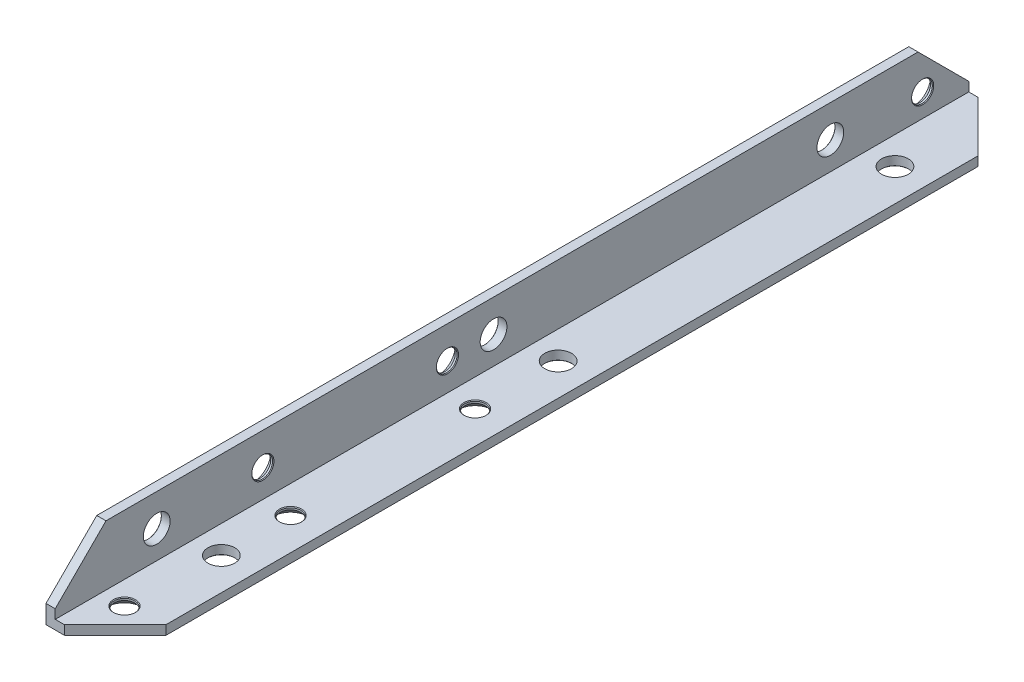
ISO-10303-21;
HEADER;
FILE_DESCRIPTION(('STEP AP214'),'2;1');
FILE_NAME('part.step','',(''),(''),'','','');
FILE_SCHEMA(('AUTOMOTIVE_DESIGN { 1 0 10303 214 1 1 1 1 }'));
ENDSEC;
DATA;
#1=APPLICATION_CONTEXT('core data for automotive mechanical design processes');
#2=APPLICATION_PROTOCOL_DEFINITION('international standard','automotive_design',2000,#1);
#3=PRODUCT_CONTEXT('',#1,'mechanical');
#4=PRODUCT('Part','Part','',(#3));
#5=PRODUCT_RELATED_PRODUCT_CATEGORY('part','',(#4));
#6=PRODUCT_DEFINITION_FORMATION('','',#4);
#7=PRODUCT_DEFINITION_CONTEXT('part definition',#1,'design');
#8=PRODUCT_DEFINITION('design','',#6,#7);
#9=PRODUCT_DEFINITION_SHAPE('','',#8);
#10=(LENGTH_UNIT() NAMED_UNIT(*) SI_UNIT(.MILLI.,.METRE.));
#11=(NAMED_UNIT(*) PLANE_ANGLE_UNIT() SI_UNIT($,.RADIAN.));
#12=(NAMED_UNIT(*) SI_UNIT($,.STERADIAN.) SOLID_ANGLE_UNIT());
#13=UNCERTAINTY_MEASURE_WITH_UNIT(LENGTH_MEASURE(1.E-05),#10,'distance_accuracy_value','');
#14=(GEOMETRIC_REPRESENTATION_CONTEXT(3) GLOBAL_UNCERTAINTY_ASSIGNED_CONTEXT((#13)) GLOBAL_UNIT_ASSIGNED_CONTEXT((#10,
#11,#12)) REPRESENTATION_CONTEXT('',''));
#15=CARTESIAN_POINT('',(0.,0.,0.));
#16=DIRECTION('',(0.,0.,1.));
#17=DIRECTION('',(1.,0.,0.));
#18=AXIS2_PLACEMENT_3D('',#15,#16,#17);
#19=CARTESIAN_POINT('',(15.,0.,198.));
#20=DIRECTION('',(0.,1.,0.));
#21=DIRECTION('',(-1.,0.,0.));
#22=AXIS2_PLACEMENT_3D('',#19,#20,#21);
#23=PLANE('',#22);
#24=CARTESIAN_POINT('',(8.,0.,95.));
#25=DIRECTION('',(0.,-1.,0.));
#26=DIRECTION('',(0.,0.,-1.));
#27=AXIS2_PLACEMENT_3D('',#24,#25,#26);
#28=CIRCLE('',#27,3.);
#29=CARTESIAN_POINT('',(8.,0.,92.));
#30=VERTEX_POINT('',#29);
#31=EDGE_CURVE('E743',#30,#30,#28,.T.);
#32=ORIENTED_EDGE('',*,*,#31,.F.);
#33=EDGE_LOOP('',(#32));
#34=FACE_BOUND('',#33,.T.);
#35=CARTESIAN_POINT('',(8.,0.,22.));
#36=DIRECTION('',(0.,-1.,0.));
#37=DIRECTION('',(0.,0.,-1.));
#38=AXIS2_PLACEMENT_3D('',#35,#36,#37);
#39=CIRCLE('',#38,3.);
#40=CARTESIAN_POINT('',(8.,0.,19.));
#41=VERTEX_POINT('',#40);
#42=EDGE_CURVE('E220',#41,#41,#39,.T.);
#43=ORIENTED_EDGE('',*,*,#42,.F.);
#44=EDGE_LOOP('',(#43));
#45=FACE_BOUND('',#44,.T.);
#46=CARTESIAN_POINT('',(8.,0.,168.));
#47=DIRECTION('',(0.,-1.,0.));
#48=DIRECTION('',(0.,0.,-1.));
#49=AXIS2_PLACEMENT_3D('',#46,#47,#48);
#50=CIRCLE('',#49,3.);
#51=CARTESIAN_POINT('',(8.,0.,165.));
#52=VERTEX_POINT('',#51);
#53=EDGE_CURVE('E213',#52,#52,#50,.T.);
#54=ORIENTED_EDGE('',*,*,#53,.F.);
#55=EDGE_LOOP('',(#54));
#56=FACE_BOUND('',#55,.T.);
#57=CARTESIAN_POINT('',(7.,0.,188.));
#58=DIRECTION('',(0.,-1.,0.));
#59=DIRECTION('',(0.,0.,-1.));
#60=AXIS2_PLACEMENT_3D('',#57,#58,#59);
#61=CIRCLE('',#60,3.7);
#62=CARTESIAN_POINT('',(7.,0.,184.3));
#63=VERTEX_POINT('',#62);
#64=EDGE_CURVE('E280',#63,#63,#61,.T.);
#65=ORIENTED_EDGE('',*,*,#64,.F.);
#66=EDGE_LOOP('',(#65));
#67=FACE_BOUND('',#66,.T.);
#68=DIRECTION('',(1.,0.,0.));
#69=VECTOR('',#68,1.);
#70=CARTESIAN_POINT('',(15.,0.,0.));
#71=LINE('',#70,#69);
#72=CARTESIAN_POINT('',(0.,0.,0.));
#73=VERTEX_POINT('',#72);
#74=CARTESIAN_POINT('',(3.99999999999999,0.,0.));
#75=VERTEX_POINT('',#74);
#76=EDGE_CURVE('E144',#73,#75,#71,.T.);
#77=ORIENTED_EDGE('',*,*,#76,.T.);
#78=DIRECTION('',(0.707106781186548,0.,0.707106781186547));
#79=VECTOR('',#78,1.);
#80=CARTESIAN_POINT('',(15.,0.,11.));
#81=LINE('',#80,#79);
#82=CARTESIAN_POINT('',(15.,0.,11.));
#83=VERTEX_POINT('',#82);
#84=EDGE_CURVE('E189',#75,#83,#81,.T.);
#85=ORIENTED_EDGE('',*,*,#84,.T.);
#86=DIRECTION('',(0.,0.,-1.));
#87=VECTOR('',#86,1.);
#88=CARTESIAN_POINT('',(15.,0.,198.));
#89=LINE('',#88,#87);
#90=CARTESIAN_POINT('',(15.,0.,187.));
#91=VERTEX_POINT('',#90);
#92=EDGE_CURVE('E161',#91,#83,#89,.T.);
#93=ORIENTED_EDGE('',*,*,#92,.F.);
#94=DIRECTION('',(0.707106781186547,0.,-0.707106781186548));
#95=VECTOR('',#94,1.);
#96=CARTESIAN_POINT('',(4.00000000000002,0.,198.));
#97=LINE('',#96,#95);
#98=CARTESIAN_POINT('',(4.00000000000002,0.,198.));
#99=VERTEX_POINT('',#98);
#100=EDGE_CURVE('E48',#91,#99,#97,.F.);
#101=ORIENTED_EDGE('',*,*,#100,.T.);
#102=DIRECTION('',(1.,0.,0.));
#103=VECTOR('',#102,1.);
#104=CARTESIAN_POINT('',(15.,0.,198.));
#105=LINE('',#104,#103);
#106=CARTESIAN_POINT('',(0.,0.,198.));
#107=VERTEX_POINT('',#106);
#108=EDGE_CURVE('E120',#107,#99,#105,.T.);
#109=ORIENTED_EDGE('',*,*,#108,.F.);
#110=DIRECTION('',(0.,0.,-1.));
#111=VECTOR('',#110,1.);
#112=CARTESIAN_POINT('',(0.,0.,198.));
#113=LINE('',#112,#111);
#114=EDGE_CURVE('E140',#107,#73,#113,.T.);
#115=ORIENTED_EDGE('',*,*,#114,.T.);
#116=EDGE_LOOP('',(#77,#85,#93,#101,#109,#115));
#117=FACE_BOUND('',#116,.T.);
#118=CARTESIAN_POINT('',(8.,0.,113.));
#119=DIRECTION('',(0.,-1.,0.));
#120=DIRECTION('',(0.,0.,-1.));
#121=AXIS2_PLACEMENT_3D('',#118,#119,#120);
#122=CIRCLE('',#121,3.7);
#123=CARTESIAN_POINT('',(8.,0.,109.3));
#124=VERTEX_POINT('',#123);
#125=EDGE_CURVE('E304',#124,#124,#122,.T.);
#126=ORIENTED_EDGE('',*,*,#125,.F.);
#127=EDGE_LOOP('',(#126));
#128=FACE_BOUND('',#127,.T.);
#129=CARTESIAN_POINT('',(8.,0.,153.));
#130=DIRECTION('',(0.,-1.,0.));
#131=DIRECTION('',(0.,0.,-1.));
#132=AXIS2_PLACEMENT_3D('',#129,#130,#131);
#133=CIRCLE('',#132,3.7);
#134=CARTESIAN_POINT('',(8.,0.,149.3));
#135=VERTEX_POINT('',#134);
#136=EDGE_CURVE('E292',#135,#135,#133,.T.);
#137=ORIENTED_EDGE('',*,*,#136,.F.);
#138=EDGE_LOOP('',(#137));
#139=FACE_BOUND('',#138,.T.);
#140=ADVANCED_FACE('F31',(#34,#45,#56,#67,#117,#128,#139),#23,.F.);
#141=CARTESIAN_POINT('',(15.,2.,198.));
#142=DIRECTION('',(-1.,0.,0.));
#143=DIRECTION('',(0.,-1.,0.));
#144=AXIS2_PLACEMENT_3D('',#141,#142,#143);
#145=PLANE('',#144);
#146=ORIENTED_EDGE('',*,*,#92,.T.);
#147=DIRECTION('',(0.,1.,0.));
#148=VECTOR('',#147,1.);
#149=CARTESIAN_POINT('',(15.,2.,11.));
#150=LINE('',#149,#148);
#151=CARTESIAN_POINT('',(15.,2.,11.));
#152=VERTEX_POINT('',#151);
#153=EDGE_CURVE('E182',#83,#152,#150,.T.);
#154=ORIENTED_EDGE('',*,*,#153,.T.);
#155=DIRECTION('',(0.,0.,-1.));
#156=VECTOR('',#155,1.);
#157=CARTESIAN_POINT('',(15.,2.,198.));
#158=LINE('',#157,#156);
#159=CARTESIAN_POINT('',(15.,2.,187.));
#160=VERTEX_POINT('',#159);
#161=EDGE_CURVE('E131',#160,#152,#158,.T.);
#162=ORIENTED_EDGE('',*,*,#161,.F.);
#163=DIRECTION('',(0.,-1.,0.));
#164=VECTOR('',#163,1.);
#165=CARTESIAN_POINT('',(15.,2.,187.));
#166=LINE('',#165,#164);
#167=EDGE_CURVE('E180',#160,#91,#166,.T.);
#168=ORIENTED_EDGE('',*,*,#167,.T.);
#169=EDGE_LOOP('',(#146,#154,#162,#168));
#170=FACE_BOUND('',#169,.T.);
#171=ADVANCED_FACE('F316',(#170),#145,.F.);
#172=CARTESIAN_POINT('',(2.,2.,198.));
#173=DIRECTION('',(0.,-1.,0.));
#174=DIRECTION('',(0.,0.,-1.));
#175=AXIS2_PLACEMENT_3D('',#172,#173,#174);
#176=PLANE('',#175);
#177=CARTESIAN_POINT('',(8.,2.,95.));
#178=DIRECTION('',(0.,-1.,0.));
#179=DIRECTION('',(0.,0.,-1.));
#180=AXIS2_PLACEMENT_3D('',#177,#178,#179);
#181=CIRCLE('',#180,2.89999999999999);
#182=CARTESIAN_POINT('',(8.,2.,92.1));
#183=VERTEX_POINT('',#182);
#184=EDGE_CURVE('E35',#183,#183,#181,.T.);
#185=ORIENTED_EDGE('',*,*,#184,.T.);
#186=EDGE_LOOP('',(#185));
#187=FACE_BOUND('',#186,.T.);
#188=CARTESIAN_POINT('',(8.,2.,22.));
#189=DIRECTION('',(0.,-1.,0.));
#190=DIRECTION('',(0.,0.,-1.));
#191=AXIS2_PLACEMENT_3D('',#188,#189,#190);
#192=CIRCLE('',#191,2.89999999999999);
#193=CARTESIAN_POINT('',(8.,2.,19.1));
#194=VERTEX_POINT('',#193);
#195=EDGE_CURVE('E211',#194,#194,#192,.T.);
#196=ORIENTED_EDGE('',*,*,#195,.T.);
#197=EDGE_LOOP('',(#196));
#198=FACE_BOUND('',#197,.T.);
#199=CARTESIAN_POINT('',(8.,2.,168.));
#200=DIRECTION('',(0.,-1.,0.));
#201=DIRECTION('',(0.,0.,-1.));
#202=AXIS2_PLACEMENT_3D('',#199,#200,#201);
#203=CIRCLE('',#202,2.89999999999999);
#204=CARTESIAN_POINT('',(8.,2.,165.1));
#205=VERTEX_POINT('',#204);
#206=EDGE_CURVE('E207',#205,#205,#203,.T.);
#207=ORIENTED_EDGE('',*,*,#206,.T.);
#208=EDGE_LOOP('',(#207));
#209=FACE_BOUND('',#208,.T.);
#210=CARTESIAN_POINT('',(7.,2.,188.));
#211=DIRECTION('',(0.,-1.,0.));
#212=DIRECTION('',(0.,0.,-1.));
#213=AXIS2_PLACEMENT_3D('',#210,#211,#212);
#214=CIRCLE('',#213,2.4);
#215=CARTESIAN_POINT('',(7.,2.,185.6));
#216=VERTEX_POINT('',#215);
#217=EDGE_CURVE('E277',#216,#216,#214,.T.);
#218=ORIENTED_EDGE('',*,*,#217,.T.);
#219=EDGE_LOOP('',(#218));
#220=FACE_BOUND('',#219,.T.);
#221=CARTESIAN_POINT('',(8.,2.,153.));
#222=DIRECTION('',(0.,-1.,0.));
#223=DIRECTION('',(0.,0.,-1.));
#224=AXIS2_PLACEMENT_3D('',#221,#222,#223);
#225=CIRCLE('',#224,2.4);
#226=CARTESIAN_POINT('',(8.,2.,150.6));
#227=VERTEX_POINT('',#226);
#228=EDGE_CURVE('E289',#227,#227,#225,.T.);
#229=ORIENTED_EDGE('',*,*,#228,.T.);
#230=EDGE_LOOP('',(#229));
#231=FACE_BOUND('',#230,.T.);
#232=CARTESIAN_POINT('',(8.,2.,113.));
#233=DIRECTION('',(0.,-1.,0.));
#234=DIRECTION('',(0.,0.,-1.));
#235=AXIS2_PLACEMENT_3D('',#232,#233,#234);
#236=CIRCLE('',#235,2.4);
#237=CARTESIAN_POINT('',(8.,2.,110.6));
#238=VERTEX_POINT('',#237);
#239=EDGE_CURVE('E301',#238,#238,#236,.T.);
#240=ORIENTED_EDGE('',*,*,#239,.T.);
#241=EDGE_LOOP('',(#240));
#242=FACE_BOUND('',#241,.T.);
#243=ORIENTED_EDGE('',*,*,#161,.T.);
#244=DIRECTION('',(-0.707106781186548,0.,-0.707106781186547));
#245=VECTOR('',#244,1.);
#246=CARTESIAN_POINT('',(15.,2.,11.));
#247=LINE('',#246,#245);
#248=CARTESIAN_POINT('',(3.99999999999999,2.,0.));
#249=VERTEX_POINT('',#248);
#250=EDGE_CURVE('E186',#152,#249,#247,.T.);
#251=ORIENTED_EDGE('',*,*,#250,.T.);
#252=DIRECTION('',(-1.,0.,0.));
#253=VECTOR('',#252,1.);
#254=CARTESIAN_POINT('',(2.,2.,0.));
#255=LINE('',#254,#253);
#256=CARTESIAN_POINT('',(2.,2.,0.));
#257=VERTEX_POINT('',#256);
#258=EDGE_CURVE('E127',#249,#257,#255,.T.);
#259=ORIENTED_EDGE('',*,*,#258,.T.);
#260=DIRECTION('',(0.,0.,-1.));
#261=VECTOR('',#260,1.);
#262=CARTESIAN_POINT('',(2.,2.,198.));
#263=LINE('',#262,#261);
#264=CARTESIAN_POINT('',(2.,2.,198.));
#265=VERTEX_POINT('',#264);
#266=EDGE_CURVE('E123',#265,#257,#263,.T.);
#267=ORIENTED_EDGE('',*,*,#266,.F.);
#268=DIRECTION('',(-1.,0.,0.));
#269=VECTOR('',#268,1.);
#270=CARTESIAN_POINT('',(2.,2.,198.));
#271=LINE('',#270,#269);
#272=CARTESIAN_POINT('',(4.00000000000002,2.,198.));
#273=VERTEX_POINT('',#272);
#274=EDGE_CURVE('E112',#273,#265,#271,.T.);
#275=ORIENTED_EDGE('',*,*,#274,.F.);
#276=DIRECTION('',(-0.707106781186547,0.,0.707106781186548));
#277=VECTOR('',#276,1.);
#278=CARTESIAN_POINT('',(4.00000000000002,2.,198.));
#279=LINE('',#278,#277);
#280=EDGE_CURVE('E56',#273,#160,#279,.F.);
#281=ORIENTED_EDGE('',*,*,#280,.T.);
#282=EDGE_LOOP('',(#243,#251,#259,#267,#275,#281));
#283=FACE_BOUND('',#282,.T.);
#284=ADVANCED_FACE('F125',(#187,#198,#209,#220,#231,#242,#283),#176,.F.);
#285=CARTESIAN_POINT('',(2.,15.,198.));
#286=DIRECTION('',(-1.,0.,0.));
#287=DIRECTION('',(0.,-1.,0.));
#288=AXIS2_PLACEMENT_3D('',#285,#286,#287);
#289=PLANE('',#288);
#290=CARTESIAN_POINT('',(2.,7.99999999999992,103.));
#291=DIRECTION('',(-1.,0.,0.));
#292=DIRECTION('',(0.,-1.,0.));
#293=AXIS2_PLACEMENT_3D('',#290,#291,#292);
#294=CIRCLE('',#293,2.89999999999999);
#295=CARTESIAN_POINT('',(2.,5.09999999999993,103.));
#296=VERTEX_POINT('',#295);
#297=EDGE_CURVE('E202',#296,#296,#294,.T.);
#298=ORIENTED_EDGE('',*,*,#297,.T.);
#299=EDGE_LOOP('',(#298));
#300=FACE_BOUND('',#299,.T.);
#301=CARTESIAN_POINT('',(2.,7.99999999999992,30.0000000000001));
#302=DIRECTION('',(-1.,0.,0.));
#303=DIRECTION('',(0.,-1.,0.));
#304=AXIS2_PLACEMENT_3D('',#301,#302,#303);
#305=CIRCLE('',#304,2.89999999999999);
#306=CARTESIAN_POINT('',(2.,5.09999999999993,30.0000000000001));
#307=VERTEX_POINT('',#306);
#308=EDGE_CURVE('E197',#307,#307,#305,.T.);
#309=ORIENTED_EDGE('',*,*,#308,.T.);
#310=EDGE_LOOP('',(#309));
#311=FACE_BOUND('',#310,.T.);
#312=CARTESIAN_POINT('',(2.,7.99999999999992,176.));
#313=DIRECTION('',(-1.,0.,0.));
#314=DIRECTION('',(0.,-1.,0.));
#315=AXIS2_PLACEMENT_3D('',#312,#313,#314);
#316=CIRCLE('',#315,2.89999999999999);
#317=CARTESIAN_POINT('',(2.,5.09999999999993,176.));
#318=VERTEX_POINT('',#317);
#319=EDGE_CURVE('E192',#318,#318,#316,.T.);
#320=ORIENTED_EDGE('',*,*,#319,.T.);
#321=EDGE_LOOP('',(#320));
#322=FACE_BOUND('',#321,.T.);
#323=CARTESIAN_POINT('',(2.,7.,10.));
#324=DIRECTION('',(-1.,0.,0.));
#325=DIRECTION('',(0.,0.,1.));
#326=AXIS2_PLACEMENT_3D('',#323,#324,#325);
#327=CIRCLE('',#326,2.4);
#328=CARTESIAN_POINT('',(2.,7.,12.4));
#329=VERTEX_POINT('',#328);
#330=EDGE_CURVE('E195',#329,#329,#327,.T.);
#331=ORIENTED_EDGE('',*,*,#330,.T.);
#332=EDGE_LOOP('',(#331));
#333=FACE_BOUND('',#332,.T.);
#334=CARTESIAN_POINT('',(2.,8.,113.));
#335=DIRECTION('',(-1.,0.,0.));
#336=DIRECTION('',(0.,0.,1.));
#337=AXIS2_PLACEMENT_3D('',#334,#335,#336);
#338=CIRCLE('',#337,2.4);
#339=CARTESIAN_POINT('',(2.,8.,115.4));
#340=VERTEX_POINT('',#339);
#341=EDGE_CURVE('E253',#340,#340,#338,.T.);
#342=ORIENTED_EDGE('',*,*,#341,.T.);
#343=EDGE_LOOP('',(#342));
#344=FACE_BOUND('',#343,.T.);
#345=CARTESIAN_POINT('',(2.,8.,153.));
#346=DIRECTION('',(-1.,0.,0.));
#347=DIRECTION('',(0.,0.,1.));
#348=AXIS2_PLACEMENT_3D('',#345,#346,#347);
#349=CIRCLE('',#348,2.4);
#350=CARTESIAN_POINT('',(2.,8.,155.4));
#351=VERTEX_POINT('',#350);
#352=EDGE_CURVE('E265',#351,#351,#349,.T.);
#353=ORIENTED_EDGE('',*,*,#352,.T.);
#354=EDGE_LOOP('',(#353));
#355=FACE_BOUND('',#354,.T.);
#356=DIRECTION('',(0.,1.,0.));
#357=VECTOR('',#356,1.);
#358=CARTESIAN_POINT('',(2.,15.,0.));
#359=LINE('',#358,#357);
#360=CARTESIAN_POINT('',(2.,4.00000000000001,0.));
#361=VERTEX_POINT('',#360);
#362=EDGE_CURVE('E149',#257,#361,#359,.T.);
#363=ORIENTED_EDGE('',*,*,#362,.T.);
#364=DIRECTION('',(0.,0.707106781186548,0.707106781186547));
#365=VECTOR('',#364,1.);
#366=CARTESIAN_POINT('',(2.,15.,11.));
#367=LINE('',#366,#365);
#368=CARTESIAN_POINT('',(2.,15.,11.));
#369=VERTEX_POINT('',#368);
#370=EDGE_CURVE('E178',#361,#369,#367,.T.);
#371=ORIENTED_EDGE('',*,*,#370,.T.);
#372=DIRECTION('',(0.,0.,-1.));
#373=VECTOR('',#372,1.);
#374=CARTESIAN_POINT('',(2.,15.,198.));
#375=LINE('',#374,#373);
#376=CARTESIAN_POINT('',(2.,15.,187.));
#377=VERTEX_POINT('',#376);
#378=EDGE_CURVE('E132',#377,#369,#375,.T.);
#379=ORIENTED_EDGE('',*,*,#378,.F.);
#380=DIRECTION('',(0.,0.707106781186547,-0.707106781186548));
#381=VECTOR('',#380,1.);
#382=CARTESIAN_POINT('',(2.,4.00000000000001,198.));
#383=LINE('',#382,#381);
#384=CARTESIAN_POINT('',(2.,4.00000000000002,198.));
#385=VERTEX_POINT('',#384);
#386=EDGE_CURVE('E137',#377,#385,#383,.F.);
#387=ORIENTED_EDGE('',*,*,#386,.T.);
#388=DIRECTION('',(0.,1.,0.));
#389=VECTOR('',#388,1.);
#390=CARTESIAN_POINT('',(2.,15.,198.));
#391=LINE('',#390,#389);
#392=EDGE_CURVE('E117',#265,#385,#391,.T.);
#393=ORIENTED_EDGE('',*,*,#392,.F.);
#394=ORIENTED_EDGE('',*,*,#266,.T.);
#395=EDGE_LOOP('',(#363,#371,#379,#387,#393,#394));
#396=FACE_BOUND('',#395,.T.);
#397=ADVANCED_FACE('F134',(#300,#311,#322,#333,#344,#355,#396),#289,.F.);
#398=CARTESIAN_POINT('',(0.,15.,198.));
#399=DIRECTION('',(0.,-1.,0.));
#400=DIRECTION('',(1.,0.,0.));
#401=AXIS2_PLACEMENT_3D('',#398,#399,#400);
#402=PLANE('',#401);
#403=ORIENTED_EDGE('',*,*,#378,.T.);
#404=DIRECTION('',(-1.,0.,0.));
#405=VECTOR('',#404,1.);
#406=CARTESIAN_POINT('',(0.,15.,11.));
#407=LINE('',#406,#405);
#408=CARTESIAN_POINT('',(0.,15.,11.));
#409=VERTEX_POINT('',#408);
#410=EDGE_CURVE('E166',#369,#409,#407,.T.);
#411=ORIENTED_EDGE('',*,*,#410,.T.);
#412=DIRECTION('',(0.,0.,-1.));
#413=VECTOR('',#412,1.);
#414=CARTESIAN_POINT('',(0.,15.,198.));
#415=LINE('',#414,#413);
#416=CARTESIAN_POINT('',(0.,15.,187.));
#417=VERTEX_POINT('',#416);
#418=EDGE_CURVE('E155',#417,#409,#415,.T.);
#419=ORIENTED_EDGE('',*,*,#418,.F.);
#420=DIRECTION('',(1.,0.,0.));
#421=VECTOR('',#420,1.);
#422=CARTESIAN_POINT('',(0.,15.,187.));
#423=LINE('',#422,#421);
#424=EDGE_CURVE('E164',#417,#377,#423,.T.);
#425=ORIENTED_EDGE('',*,*,#424,.T.);
#426=EDGE_LOOP('',(#403,#411,#419,#425));
#427=FACE_BOUND('',#426,.T.);
#428=ADVANCED_FACE('F334',(#427),#402,.F.);
#429=CARTESIAN_POINT('',(0.,0.,198.));
#430=DIRECTION('',(1.,0.,0.));
#431=DIRECTION('',(0.,0.,-1.));
#432=AXIS2_PLACEMENT_3D('',#429,#430,#431);
#433=PLANE('',#432);
#434=CARTESIAN_POINT('',(0.,7.99999999999992,103.));
#435=DIRECTION('',(-1.,0.,0.));
#436=DIRECTION('',(0.,0.,1.));
#437=AXIS2_PLACEMENT_3D('',#434,#435,#436);
#438=CIRCLE('',#437,3.);
#439=CARTESIAN_POINT('',(0.,7.99999999999992,106.));
#440=VERTEX_POINT('',#439);
#441=EDGE_CURVE('E209',#440,#440,#438,.T.);
#442=ORIENTED_EDGE('',*,*,#441,.F.);
#443=EDGE_LOOP('',(#442));
#444=FACE_BOUND('',#443,.T.);
#445=CARTESIAN_POINT('',(0.,7.99999999999992,30.0000000000001));
#446=DIRECTION('',(-1.,0.,0.));
#447=DIRECTION('',(0.,0.,1.));
#448=AXIS2_PLACEMENT_3D('',#445,#446,#447);
#449=CIRCLE('',#448,3.);
#450=CARTESIAN_POINT('',(0.,7.99999999999992,33.0000000000001));
#451=VERTEX_POINT('',#450);
#452=EDGE_CURVE('E205',#451,#451,#449,.T.);
#453=ORIENTED_EDGE('',*,*,#452,.F.);
#454=EDGE_LOOP('',(#453));
#455=FACE_BOUND('',#454,.T.);
#456=CARTESIAN_POINT('',(0.,7.99999999999992,176.));
#457=DIRECTION('',(-1.,0.,0.));
#458=DIRECTION('',(0.,0.,1.));
#459=AXIS2_PLACEMENT_3D('',#456,#457,#458);
#460=CIRCLE('',#459,3.);
#461=CARTESIAN_POINT('',(0.,7.99999999999992,179.));
#462=VERTEX_POINT('',#461);
#463=EDGE_CURVE('E200',#462,#462,#460,.T.);
#464=ORIENTED_EDGE('',*,*,#463,.F.);
#465=EDGE_LOOP('',(#464));
#466=FACE_BOUND('',#465,.T.);
#467=CARTESIAN_POINT('',(0.,7.,10.));
#468=DIRECTION('',(-1.,0.,0.));
#469=DIRECTION('',(0.,0.,1.));
#470=AXIS2_PLACEMENT_3D('',#467,#468,#469);
#471=CIRCLE('',#470,3.7);
#472=CARTESIAN_POINT('',(0.,7.,13.7));
#473=VERTEX_POINT('',#472);
#474=EDGE_CURVE('E244',#473,#473,#471,.T.);
#475=ORIENTED_EDGE('',*,*,#474,.F.);
#476=EDGE_LOOP('',(#475));
#477=FACE_BOUND('',#476,.T.);
#478=CARTESIAN_POINT('',(0.,8.,113.));
#479=DIRECTION('',(-1.,0.,0.));
#480=DIRECTION('',(0.,0.,1.));
#481=AXIS2_PLACEMENT_3D('',#478,#479,#480);
#482=CIRCLE('',#481,3.7);
#483=CARTESIAN_POINT('',(0.,8.,116.7));
#484=VERTEX_POINT('',#483);
#485=EDGE_CURVE('E256',#484,#484,#482,.T.);
#486=ORIENTED_EDGE('',*,*,#485,.F.);
#487=EDGE_LOOP('',(#486));
#488=FACE_BOUND('',#487,.T.);
#489=CARTESIAN_POINT('',(0.,8.,153.));
#490=DIRECTION('',(-1.,0.,0.));
#491=DIRECTION('',(0.,0.,1.));
#492=AXIS2_PLACEMENT_3D('',#489,#490,#491);
#493=CIRCLE('',#492,3.7);
#494=CARTESIAN_POINT('',(0.,8.,156.7));
#495=VERTEX_POINT('',#494);
#496=EDGE_CURVE('E268',#495,#495,#493,.T.);
#497=ORIENTED_EDGE('',*,*,#496,.F.);
#498=EDGE_LOOP('',(#497));
#499=FACE_BOUND('',#498,.T.);
#500=ORIENTED_EDGE('',*,*,#418,.T.);
#501=DIRECTION('',(0.,-0.707106781186548,-0.707106781186547));
#502=VECTOR('',#501,1.);
#503=CARTESIAN_POINT('',(0.,15.,11.));
#504=LINE('',#503,#502);
#505=CARTESIAN_POINT('',(0.,4.00000000000001,0.));
#506=VERTEX_POINT('',#505);
#507=EDGE_CURVE('E171',#409,#506,#504,.T.);
#508=ORIENTED_EDGE('',*,*,#507,.T.);
#509=DIRECTION('',(0.,-1.,0.));
#510=VECTOR('',#509,1.);
#511=CARTESIAN_POINT('',(0.,0.,0.));
#512=LINE('',#511,#510);
#513=EDGE_CURVE('E151',#506,#73,#512,.T.);
#514=ORIENTED_EDGE('',*,*,#513,.T.);
#515=ORIENTED_EDGE('',*,*,#114,.F.);
#516=DIRECTION('',(0.,-1.,0.));
#517=VECTOR('',#516,1.);
#518=CARTESIAN_POINT('',(0.,0.,198.));
#519=LINE('',#518,#517);
#520=CARTESIAN_POINT('',(0.,4.00000000000001,198.));
#521=VERTEX_POINT('',#520);
#522=EDGE_CURVE('E138',#521,#107,#519,.T.);
#523=ORIENTED_EDGE('',*,*,#522,.F.);
#524=DIRECTION('',(0.,-0.707106781186547,0.707106781186548));
#525=VECTOR('',#524,1.);
#526=CARTESIAN_POINT('',(0.,4.00000000000001,198.));
#527=LINE('',#526,#525);
#528=EDGE_CURVE('E169',#521,#417,#527,.F.);
#529=ORIENTED_EDGE('',*,*,#528,.T.);
#530=EDGE_LOOP('',(#500,#508,#514,#515,#523,#529));
#531=FACE_BOUND('',#530,.T.);
#532=ADVANCED_FACE('F337',(#444,#455,#466,#477,#488,#499,#531),#433,.F.);
#533=CARTESIAN_POINT('',(0.,0.,198.));
#534=DIRECTION('',(0.,0.,-1.));
#535=DIRECTION('',(-1.,0.,0.));
#536=AXIS2_PLACEMENT_3D('',#533,#534,#535);
#537=PLANE('',#536);
#538=ORIENTED_EDGE('',*,*,#108,.T.);
#539=DIRECTION('',(0.,1.,0.));
#540=VECTOR('',#539,1.);
#541=CARTESIAN_POINT('',(4.00000000000002,0.,198.));
#542=LINE('',#541,#540);
#543=EDGE_CURVE('E11',#99,#273,#542,.T.);
#544=ORIENTED_EDGE('',*,*,#543,.T.);
#545=ORIENTED_EDGE('',*,*,#274,.T.);
#546=ORIENTED_EDGE('',*,*,#392,.T.);
#547=DIRECTION('',(-1.,0.,0.));
#548=VECTOR('',#547,1.);
#549=CARTESIAN_POINT('',(0.,4.00000000000001,198.));
#550=LINE('',#549,#548);
#551=EDGE_CURVE('E40',#385,#521,#550,.T.);
#552=ORIENTED_EDGE('',*,*,#551,.T.);
#553=ORIENTED_EDGE('',*,*,#522,.T.);
#554=EDGE_LOOP('',(#538,#544,#545,#546,#552,#553));
#555=FACE_BOUND('',#554,.T.);
#556=ADVANCED_FACE('F114',(#555),#537,.F.);
#557=CARTESIAN_POINT('',(0.,0.,0.));
#558=DIRECTION('',(0.,0.,-1.));
#559=DIRECTION('',(-1.,0.,0.));
#560=AXIS2_PLACEMENT_3D('',#557,#558,#559);
#561=PLANE('',#560);
#562=ORIENTED_EDGE('',*,*,#513,.F.);
#563=DIRECTION('',(1.,0.,0.));
#564=VECTOR('',#563,1.);
#565=CARTESIAN_POINT('',(2.00000000000001,4.00000000000001,0.));
#566=LINE('',#565,#564);
#567=EDGE_CURVE('E175',#506,#361,#566,.T.);
#568=ORIENTED_EDGE('',*,*,#567,.T.);
#569=ORIENTED_EDGE('',*,*,#362,.F.);
#570=ORIENTED_EDGE('',*,*,#258,.F.);
#571=DIRECTION('',(0.,-1.,0.));
#572=VECTOR('',#571,1.);
#573=CARTESIAN_POINT('',(3.99999999999999,0.,0.));
#574=LINE('',#573,#572);
#575=EDGE_CURVE('E173',#249,#75,#574,.T.);
#576=ORIENTED_EDGE('',*,*,#575,.T.);
#577=ORIENTED_EDGE('',*,*,#76,.F.);
#578=EDGE_LOOP('',(#562,#568,#569,#570,#576,#577));
#579=FACE_BOUND('',#578,.T.);
#580=ADVANCED_FACE('F326',(#579),#561,.T.);
#581=CARTESIAN_POINT('',(0.,15.,11.));
#582=DIRECTION('',(0.,0.707106781186547,-0.707106781186548));
#583=DIRECTION('',(0.,0.707106781186548,0.707106781186547));
#584=AXIS2_PLACEMENT_3D('',#581,#582,#583);
#585=PLANE('',#584);
#586=ORIENTED_EDGE('',*,*,#370,.F.);
#587=ORIENTED_EDGE('',*,*,#567,.F.);
#588=ORIENTED_EDGE('',*,*,#507,.F.);
#589=ORIENTED_EDGE('',*,*,#410,.F.);
#590=EDGE_LOOP('',(#586,#587,#588,#589));
#591=FACE_BOUND('',#590,.T.);
#592=ADVANCED_FACE('F331',(#591),#585,.T.);
#593=CARTESIAN_POINT('',(15.,2.,11.));
#594=DIRECTION('',(0.707106781186547,0.,-0.707106781186548));
#595=DIRECTION('',(-0.707106781186548,0.,-0.707106781186547));
#596=AXIS2_PLACEMENT_3D('',#593,#594,#595);
#597=PLANE('',#596);
#598=ORIENTED_EDGE('',*,*,#84,.F.);
#599=ORIENTED_EDGE('',*,*,#575,.F.);
#600=ORIENTED_EDGE('',*,*,#250,.F.);
#601=ORIENTED_EDGE('',*,*,#153,.F.);
#602=EDGE_LOOP('',(#598,#599,#600,#601));
#603=FACE_BOUND('',#602,.T.);
#604=ADVANCED_FACE('F323',(#603),#597,.T.);
#605=CARTESIAN_POINT('',(4.00000000000002,0.,198.));
#606=DIRECTION('',(-0.707106781186548,0.,-0.707106781186547));
#607=DIRECTION('',(-0.707106781186547,0.,0.707106781186548));
#608=AXIS2_PLACEMENT_3D('',#605,#606,#607);
#609=PLANE('',#608);
#610=ORIENTED_EDGE('',*,*,#100,.F.);
#611=ORIENTED_EDGE('',*,*,#167,.F.);
#612=ORIENTED_EDGE('',*,*,#280,.F.);
#613=ORIENTED_EDGE('',*,*,#543,.F.);
#614=EDGE_LOOP('',(#610,#611,#612,#613));
#615=FACE_BOUND('',#614,.T.);
#616=ADVANCED_FACE('F313',(#615),#609,.F.);
#617=CARTESIAN_POINT('',(0.,4.00000000000001,198.));
#618=DIRECTION('',(0.,-0.707106781186548,-0.707106781186547));
#619=DIRECTION('',(0.,0.707106781186547,-0.707106781186548));
#620=AXIS2_PLACEMENT_3D('',#617,#618,#619);
#621=PLANE('',#620);
#622=ORIENTED_EDGE('',*,*,#386,.F.);
#623=ORIENTED_EDGE('',*,*,#424,.F.);
#624=ORIENTED_EDGE('',*,*,#528,.F.);
#625=ORIENTED_EDGE('',*,*,#551,.F.);
#626=EDGE_LOOP('',(#622,#623,#624,#625));
#627=FACE_BOUND('',#626,.T.);
#628=ADVANCED_FACE('F33',(#627),#621,.F.);
#629=CARTESIAN_POINT('',(8.,1.85,113.));
#630=DIRECTION('',(0.,1.,0.));
#631=DIRECTION('',(0.,0.,1.));
#632=AXIS2_PLACEMENT_3D('',#629,#630,#631);
#633=CONICAL_SURFACE('',#632,2.25,0.785398163397442);
#634=ORIENTED_EDGE('',*,*,#239,.F.);
#635=EDGE_LOOP('',(#634));
#636=FACE_BOUND('',#635,.T.);
#637=CARTESIAN_POINT('',(8.,1.85,113.));
#638=DIRECTION('',(0.,-1.,0.));
#639=DIRECTION('',(0.,0.,-1.));
#640=AXIS2_PLACEMENT_3D('',#637,#638,#639);
#641=CIRCLE('',#640,2.25);
#642=CARTESIAN_POINT('',(8.,1.85,110.75));
#643=VERTEX_POINT('',#642);
#644=EDGE_CURVE('E147',#643,#643,#641,.T.);
#645=ORIENTED_EDGE('',*,*,#644,.T.);
#646=EDGE_LOOP('',(#645));
#647=FACE_BOUND('',#646,.T.);
#648=ADVANCED_FACE('F340',(#636,#647),#633,.F.);
#649=CARTESIAN_POINT('',(8.,0.,113.));
#650=DIRECTION('',(0.,-1.,0.));
#651=DIRECTION('',(0.,0.,-1.));
#652=AXIS2_PLACEMENT_3D('',#649,#650,#651);
#653=CYLINDRICAL_SURFACE('',#652,2.24999999999999);
#654=ORIENTED_EDGE('',*,*,#644,.F.);
#655=EDGE_LOOP('',(#654));
#656=FACE_BOUND('',#655,.T.);
#657=CARTESIAN_POINT('',(8.,1.44999999999999,113.));
#658=DIRECTION('',(0.,-1.,0.));
#659=DIRECTION('',(0.,0.,-1.));
#660=AXIS2_PLACEMENT_3D('',#657,#658,#659);
#661=CIRCLE('',#660,2.24999999999999);
#662=CARTESIAN_POINT('',(8.,1.44999999999999,110.75));
#663=VERTEX_POINT('',#662);
#664=EDGE_CURVE('E307',#663,#663,#661,.T.);
#665=ORIENTED_EDGE('',*,*,#664,.T.);
#666=EDGE_LOOP('',(#665));
#667=FACE_BOUND('',#666,.T.);
#668=ADVANCED_FACE('F345',(#656,#667),#653,.F.);
#669=CARTESIAN_POINT('',(8.,0.,113.));
#670=DIRECTION('',(0.,-1.,0.));
#671=DIRECTION('',(0.,0.,-1.));
#672=AXIS2_PLACEMENT_3D('',#669,#670,#671);
#673=CONICAL_SURFACE('',#672,3.7,0.785398163397454);
#674=ORIENTED_EDGE('',*,*,#664,.F.);
#675=EDGE_LOOP('',(#674));
#676=FACE_BOUND('',#675,.T.);
#677=ORIENTED_EDGE('',*,*,#125,.T.);
#678=EDGE_LOOP('',(#677));
#679=FACE_BOUND('',#678,.T.);
#680=ADVANCED_FACE('F391',(#676,#679),#673,.F.);
#681=CARTESIAN_POINT('',(8.,1.85,153.));
#682=DIRECTION('',(0.,1.,0.));
#683=DIRECTION('',(0.,0.,1.));
#684=AXIS2_PLACEMENT_3D('',#681,#682,#683);
#685=CONICAL_SURFACE('',#684,2.25,0.785398163397442);
#686=ORIENTED_EDGE('',*,*,#228,.F.);
#687=EDGE_LOOP('',(#686));
#688=FACE_BOUND('',#687,.T.);
#689=CARTESIAN_POINT('',(8.,1.85,153.));
#690=DIRECTION('',(0.,-1.,0.));
#691=DIRECTION('',(0.,0.,-1.));
#692=AXIS2_PLACEMENT_3D('',#689,#690,#691);
#693=CIRCLE('',#692,2.25);
#694=CARTESIAN_POINT('',(8.,1.85,150.75));
#695=VERTEX_POINT('',#694);
#696=EDGE_CURVE('E298',#695,#695,#693,.T.);
#697=ORIENTED_EDGE('',*,*,#696,.T.);
#698=EDGE_LOOP('',(#697));
#699=FACE_BOUND('',#698,.T.);
#700=ADVANCED_FACE('F401',(#688,#699),#685,.F.);
#701=CARTESIAN_POINT('',(8.,0.,153.));
#702=DIRECTION('',(0.,-1.,0.));
#703=DIRECTION('',(0.,0.,-1.));
#704=AXIS2_PLACEMENT_3D('',#701,#702,#703);
#705=CYLINDRICAL_SURFACE('',#704,2.24999999999999);
#706=ORIENTED_EDGE('',*,*,#696,.F.);
#707=EDGE_LOOP('',(#706));
#708=FACE_BOUND('',#707,.T.);
#709=CARTESIAN_POINT('',(8.,1.44999999999999,153.));
#710=DIRECTION('',(0.,-1.,0.));
#711=DIRECTION('',(0.,0.,-1.));
#712=AXIS2_PLACEMENT_3D('',#709,#710,#711);
#713=CIRCLE('',#712,2.24999999999999);
#714=CARTESIAN_POINT('',(8.,1.44999999999999,150.75));
#715=VERTEX_POINT('',#714);
#716=EDGE_CURVE('E295',#715,#715,#713,.T.);
#717=ORIENTED_EDGE('',*,*,#716,.T.);
#718=EDGE_LOOP('',(#717));
#719=FACE_BOUND('',#718,.T.);
#720=ADVANCED_FACE('F411',(#708,#719),#705,.F.);
#721=CARTESIAN_POINT('',(8.,0.,153.));
#722=DIRECTION('',(0.,-1.,0.));
#723=DIRECTION('',(0.,0.,-1.));
#724=AXIS2_PLACEMENT_3D('',#721,#722,#723);
#725=CONICAL_SURFACE('',#724,3.7,0.785398163397454);
#726=ORIENTED_EDGE('',*,*,#716,.F.);
#727=EDGE_LOOP('',(#726));
#728=FACE_BOUND('',#727,.T.);
#729=ORIENTED_EDGE('',*,*,#136,.T.);
#730=EDGE_LOOP('',(#729));
#731=FACE_BOUND('',#730,.T.);
#732=ADVANCED_FACE('F421',(#728,#731),#725,.F.);
#733=CARTESIAN_POINT('',(7.,1.85,188.));
#734=DIRECTION('',(0.,1.,0.));
#735=DIRECTION('',(0.,0.,1.));
#736=AXIS2_PLACEMENT_3D('',#733,#734,#735);
#737=CONICAL_SURFACE('',#736,2.25,0.785398163397442);
#738=ORIENTED_EDGE('',*,*,#217,.F.);
#739=EDGE_LOOP('',(#738));
#740=FACE_BOUND('',#739,.T.);
#741=CARTESIAN_POINT('',(7.,1.85,188.));
#742=DIRECTION('',(0.,-1.,0.));
#743=DIRECTION('',(0.,0.,-1.));
#744=AXIS2_PLACEMENT_3D('',#741,#742,#743);
#745=CIRCLE('',#744,2.25);
#746=CARTESIAN_POINT('',(7.,1.85,185.75));
#747=VERTEX_POINT('',#746);
#748=EDGE_CURVE('E286',#747,#747,#745,.T.);
#749=ORIENTED_EDGE('',*,*,#748,.T.);
#750=EDGE_LOOP('',(#749));
#751=FACE_BOUND('',#750,.T.);
#752=ADVANCED_FACE('F431',(#740,#751),#737,.F.);
#753=CARTESIAN_POINT('',(7.,0.,188.));
#754=DIRECTION('',(0.,-1.,0.));
#755=DIRECTION('',(0.,0.,-1.));
#756=AXIS2_PLACEMENT_3D('',#753,#754,#755);
#757=CYLINDRICAL_SURFACE('',#756,2.24999999999999);
#758=ORIENTED_EDGE('',*,*,#748,.F.);
#759=EDGE_LOOP('',(#758));
#760=FACE_BOUND('',#759,.T.);
#761=CARTESIAN_POINT('',(7.,1.44999999999999,188.));
#762=DIRECTION('',(0.,-1.,0.));
#763=DIRECTION('',(0.,0.,-1.));
#764=AXIS2_PLACEMENT_3D('',#761,#762,#763);
#765=CIRCLE('',#764,2.24999999999999);
#766=CARTESIAN_POINT('',(7.,1.44999999999999,185.75));
#767=VERTEX_POINT('',#766);
#768=EDGE_CURVE('E283',#767,#767,#765,.T.);
#769=ORIENTED_EDGE('',*,*,#768,.T.);
#770=EDGE_LOOP('',(#769));
#771=FACE_BOUND('',#770,.T.);
#772=ADVANCED_FACE('F441',(#760,#771),#757,.F.);
#773=CARTESIAN_POINT('',(7.,0.,188.));
#774=DIRECTION('',(0.,-1.,0.));
#775=DIRECTION('',(0.,0.,-1.));
#776=AXIS2_PLACEMENT_3D('',#773,#774,#775);
#777=CONICAL_SURFACE('',#776,3.7,0.785398163397455);
#778=ORIENTED_EDGE('',*,*,#768,.F.);
#779=EDGE_LOOP('',(#778));
#780=FACE_BOUND('',#779,.T.);
#781=ORIENTED_EDGE('',*,*,#64,.T.);
#782=EDGE_LOOP('',(#781));
#783=FACE_BOUND('',#782,.T.);
#784=ADVANCED_FACE('F451',(#780,#783),#777,.F.);
#785=CARTESIAN_POINT('',(1.85,8.,153.));
#786=DIRECTION('',(1.,0.,0.));
#787=DIRECTION('',(0.,0.,-1.));
#788=AXIS2_PLACEMENT_3D('',#785,#786,#787);
#789=CONICAL_SURFACE('',#788,2.25,0.785398163397442);
#790=ORIENTED_EDGE('',*,*,#352,.F.);
#791=EDGE_LOOP('',(#790));
#792=FACE_BOUND('',#791,.T.);
#793=CARTESIAN_POINT('',(1.85,8.,153.));
#794=DIRECTION('',(-1.,0.,0.));
#795=DIRECTION('',(0.,0.,1.));
#796=AXIS2_PLACEMENT_3D('',#793,#794,#795);
#797=CIRCLE('',#796,2.25);
#798=CARTESIAN_POINT('',(1.85,8.,155.25));
#799=VERTEX_POINT('',#798);
#800=EDGE_CURVE('E274',#799,#799,#797,.T.);
#801=ORIENTED_EDGE('',*,*,#800,.T.);
#802=EDGE_LOOP('',(#801));
#803=FACE_BOUND('',#802,.T.);
#804=ADVANCED_FACE('F461',(#792,#803),#789,.F.);
#805=CARTESIAN_POINT('',(0.,8.,153.));
#806=DIRECTION('',(-1.,0.,0.));
#807=DIRECTION('',(0.,0.,1.));
#808=AXIS2_PLACEMENT_3D('',#805,#806,#807);
#809=CYLINDRICAL_SURFACE('',#808,2.24999999999999);
#810=ORIENTED_EDGE('',*,*,#800,.F.);
#811=EDGE_LOOP('',(#810));
#812=FACE_BOUND('',#811,.T.);
#813=CARTESIAN_POINT('',(1.44999999999999,8.,153.));
#814=DIRECTION('',(-1.,0.,0.));
#815=DIRECTION('',(0.,0.,1.));
#816=AXIS2_PLACEMENT_3D('',#813,#814,#815);
#817=CIRCLE('',#816,2.24999999999999);
#818=CARTESIAN_POINT('',(1.44999999999999,8.,155.25));
#819=VERTEX_POINT('',#818);
#820=EDGE_CURVE('E271',#819,#819,#817,.T.);
#821=ORIENTED_EDGE('',*,*,#820,.T.);
#822=EDGE_LOOP('',(#821));
#823=FACE_BOUND('',#822,.T.);
#824=ADVANCED_FACE('F471',(#812,#823),#809,.F.);
#825=CARTESIAN_POINT('',(0.,8.,153.));
#826=DIRECTION('',(-1.,0.,0.));
#827=DIRECTION('',(0.,0.,1.));
#828=AXIS2_PLACEMENT_3D('',#825,#826,#827);
#829=CONICAL_SURFACE('',#828,3.7,0.785398163397454);
#830=ORIENTED_EDGE('',*,*,#820,.F.);
#831=EDGE_LOOP('',(#830));
#832=FACE_BOUND('',#831,.T.);
#833=ORIENTED_EDGE('',*,*,#496,.T.);
#834=EDGE_LOOP('',(#833));
#835=FACE_BOUND('',#834,.T.);
#836=ADVANCED_FACE('F481',(#832,#835),#829,.F.);
#837=CARTESIAN_POINT('',(1.85,8.,113.));
#838=DIRECTION('',(1.,0.,0.));
#839=DIRECTION('',(0.,0.,-1.));
#840=AXIS2_PLACEMENT_3D('',#837,#838,#839);
#841=CONICAL_SURFACE('',#840,2.25,0.785398163397442);
#842=ORIENTED_EDGE('',*,*,#341,.F.);
#843=EDGE_LOOP('',(#842));
#844=FACE_BOUND('',#843,.T.);
#845=CARTESIAN_POINT('',(1.85,8.,113.));
#846=DIRECTION('',(-1.,0.,0.));
#847=DIRECTION('',(0.,0.,1.));
#848=AXIS2_PLACEMENT_3D('',#845,#846,#847);
#849=CIRCLE('',#848,2.25);
#850=CARTESIAN_POINT('',(1.85,8.,115.25));
#851=VERTEX_POINT('',#850);
#852=EDGE_CURVE('E262',#851,#851,#849,.T.);
#853=ORIENTED_EDGE('',*,*,#852,.T.);
#854=EDGE_LOOP('',(#853));
#855=FACE_BOUND('',#854,.T.);
#856=ADVANCED_FACE('F491',(#844,#855),#841,.F.);
#857=CARTESIAN_POINT('',(0.,8.,113.));
#858=DIRECTION('',(-1.,0.,0.));
#859=DIRECTION('',(0.,0.,1.));
#860=AXIS2_PLACEMENT_3D('',#857,#858,#859);
#861=CYLINDRICAL_SURFACE('',#860,2.24999999999999);
#862=ORIENTED_EDGE('',*,*,#852,.F.);
#863=EDGE_LOOP('',(#862));
#864=FACE_BOUND('',#863,.T.);
#865=CARTESIAN_POINT('',(1.44999999999999,8.,113.));
#866=DIRECTION('',(-1.,0.,0.));
#867=DIRECTION('',(0.,0.,1.));
#868=AXIS2_PLACEMENT_3D('',#865,#866,#867);
#869=CIRCLE('',#868,2.24999999999999);
#870=CARTESIAN_POINT('',(1.44999999999999,8.,115.25));
#871=VERTEX_POINT('',#870);
#872=EDGE_CURVE('E259',#871,#871,#869,.T.);
#873=ORIENTED_EDGE('',*,*,#872,.T.);
#874=EDGE_LOOP('',(#873));
#875=FACE_BOUND('',#874,.T.);
#876=ADVANCED_FACE('F501',(#864,#875),#861,.F.);
#877=CARTESIAN_POINT('',(0.,8.,113.));
#878=DIRECTION('',(-1.,0.,0.));
#879=DIRECTION('',(0.,0.,1.));
#880=AXIS2_PLACEMENT_3D('',#877,#878,#879);
#881=CONICAL_SURFACE('',#880,3.7,0.785398163397454);
#882=ORIENTED_EDGE('',*,*,#872,.F.);
#883=EDGE_LOOP('',(#882));
#884=FACE_BOUND('',#883,.T.);
#885=ORIENTED_EDGE('',*,*,#485,.T.);
#886=EDGE_LOOP('',(#885));
#887=FACE_BOUND('',#886,.T.);
#888=ADVANCED_FACE('F511',(#884,#887),#881,.F.);
#889=CARTESIAN_POINT('',(1.85,7.,10.));
#890=DIRECTION('',(1.,0.,0.));
#891=DIRECTION('',(0.,0.,-1.));
#892=AXIS2_PLACEMENT_3D('',#889,#890,#891);
#893=CONICAL_SURFACE('',#892,2.25,0.785398163397442);
#894=ORIENTED_EDGE('',*,*,#330,.F.);
#895=EDGE_LOOP('',(#894));
#896=FACE_BOUND('',#895,.T.);
#897=CARTESIAN_POINT('',(1.85,7.,10.));
#898=DIRECTION('',(-1.,0.,0.));
#899=DIRECTION('',(0.,0.,1.));
#900=AXIS2_PLACEMENT_3D('',#897,#898,#899);
#901=CIRCLE('',#900,2.25);
#902=CARTESIAN_POINT('',(1.85,7.,12.25));
#903=VERTEX_POINT('',#902);
#904=EDGE_CURVE('E250',#903,#903,#901,.T.);
#905=ORIENTED_EDGE('',*,*,#904,.T.);
#906=EDGE_LOOP('',(#905));
#907=FACE_BOUND('',#906,.T.);
#908=ADVANCED_FACE('F521',(#896,#907),#893,.F.);
#909=CARTESIAN_POINT('',(0.,7.,10.));
#910=DIRECTION('',(-1.,0.,0.));
#911=DIRECTION('',(0.,0.,1.));
#912=AXIS2_PLACEMENT_3D('',#909,#910,#911);
#913=CYLINDRICAL_SURFACE('',#912,2.24999999999999);
#914=ORIENTED_EDGE('',*,*,#904,.F.);
#915=EDGE_LOOP('',(#914));
#916=FACE_BOUND('',#915,.T.);
#917=CARTESIAN_POINT('',(1.44999999999999,7.,10.));
#918=DIRECTION('',(-1.,0.,0.));
#919=DIRECTION('',(0.,0.,1.));
#920=AXIS2_PLACEMENT_3D('',#917,#918,#919);
#921=CIRCLE('',#920,2.24999999999999);
#922=CARTESIAN_POINT('',(1.44999999999999,7.,12.25));
#923=VERTEX_POINT('',#922);
#924=EDGE_CURVE('E247',#923,#923,#921,.T.);
#925=ORIENTED_EDGE('',*,*,#924,.T.);
#926=EDGE_LOOP('',(#925));
#927=FACE_BOUND('',#926,.T.);
#928=ADVANCED_FACE('F531',(#916,#927),#913,.F.);
#929=CARTESIAN_POINT('',(0.,7.,10.));
#930=DIRECTION('',(-1.,0.,0.));
#931=DIRECTION('',(0.,0.,1.));
#932=AXIS2_PLACEMENT_3D('',#929,#930,#931);
#933=CONICAL_SURFACE('',#932,3.7,0.785398163397455);
#934=ORIENTED_EDGE('',*,*,#924,.F.);
#935=EDGE_LOOP('',(#934));
#936=FACE_BOUND('',#935,.T.);
#937=ORIENTED_EDGE('',*,*,#474,.T.);
#938=EDGE_LOOP('',(#937));
#939=FACE_BOUND('',#938,.T.);
#940=ADVANCED_FACE('F541',(#936,#939),#933,.F.);
#941=CARTESIAN_POINT('',(0.,7.99999999999992,176.));
#942=DIRECTION('',(-1.,0.,0.));
#943=DIRECTION('',(0.,0.,1.));
#944=AXIS2_PLACEMENT_3D('',#941,#942,#943);
#945=CYLINDRICAL_SURFACE('',#944,2.89999999999999);
#946=CARTESIAN_POINT('',(0.099999999999999,7.99999999999992,176.));
#947=DIRECTION('',(-1.,0.,0.));
#948=DIRECTION('',(0.,0.,1.));
#949=AXIS2_PLACEMENT_3D('',#946,#947,#948);
#950=CIRCLE('',#949,2.9);
#951=CARTESIAN_POINT('',(0.099999999999999,7.99999999999992,178.9));
#952=VERTEX_POINT('',#951);
#953=EDGE_CURVE('E196',#952,#952,#950,.T.);
#954=ORIENTED_EDGE('',*,*,#953,.T.);
#955=EDGE_LOOP('',(#954));
#956=FACE_BOUND('',#955,.T.);
#957=ORIENTED_EDGE('',*,*,#319,.F.);
#958=EDGE_LOOP('',(#957));
#959=FACE_BOUND('',#958,.T.);
#960=ADVANCED_FACE('F551',(#956,#959),#945,.F.);
#961=CARTESIAN_POINT('',(0.,7.99999999999992,176.));
#962=DIRECTION('',(-1.,0.,0.));
#963=DIRECTION('',(0.,0.,1.));
#964=AXIS2_PLACEMENT_3D('',#961,#962,#963);
#965=CONICAL_SURFACE('',#964,3.,0.785398163397442);
#966=ORIENTED_EDGE('',*,*,#953,.F.);
#967=EDGE_LOOP('',(#966));
#968=FACE_BOUND('',#967,.T.);
#969=ORIENTED_EDGE('',*,*,#463,.T.);
#970=EDGE_LOOP('',(#969));
#971=FACE_BOUND('',#970,.T.);
#972=ADVANCED_FACE('F585',(#968,#971),#965,.F.);
#973=CARTESIAN_POINT('',(0.,7.99999999999992,30.0000000000001));
#974=DIRECTION('',(-1.,0.,0.));
#975=DIRECTION('',(0.,0.,1.));
#976=AXIS2_PLACEMENT_3D('',#973,#974,#975);
#977=CYLINDRICAL_SURFACE('',#976,2.89999999999999);
#978=CARTESIAN_POINT('',(0.099999999999999,7.99999999999992,30.0000000000001));
#979=DIRECTION('',(-1.,0.,0.));
#980=DIRECTION('',(0.,0.,1.));
#981=AXIS2_PLACEMENT_3D('',#978,#979,#980);
#982=CIRCLE('',#981,2.9);
#983=CARTESIAN_POINT('',(0.099999999999999,7.99999999999992,32.9000000000001));
#984=VERTEX_POINT('',#983);
#985=EDGE_CURVE('E201',#984,#984,#982,.T.);
#986=ORIENTED_EDGE('',*,*,#985,.T.);
#987=EDGE_LOOP('',(#986));
#988=FACE_BOUND('',#987,.T.);
#989=ORIENTED_EDGE('',*,*,#308,.F.);
#990=EDGE_LOOP('',(#989));
#991=FACE_BOUND('',#990,.T.);
#992=ADVANCED_FACE('F595',(#988,#991),#977,.F.);
#993=CARTESIAN_POINT('',(0.,7.99999999999992,30.0000000000001));
#994=DIRECTION('',(-1.,0.,0.));
#995=DIRECTION('',(0.,0.,1.));
#996=AXIS2_PLACEMENT_3D('',#993,#994,#995);
#997=CONICAL_SURFACE('',#996,3.,0.785398163397442);
#998=ORIENTED_EDGE('',*,*,#985,.F.);
#999=EDGE_LOOP('',(#998));
#1000=FACE_BOUND('',#999,.T.);
#1001=ORIENTED_EDGE('',*,*,#452,.T.);
#1002=EDGE_LOOP('',(#1001));
#1003=FACE_BOUND('',#1002,.T.);
#1004=ADVANCED_FACE('F605',(#1000,#1003),#997,.F.);
#1005=CARTESIAN_POINT('',(0.,7.99999999999992,103.));
#1006=DIRECTION('',(-1.,0.,0.));
#1007=DIRECTION('',(0.,0.,1.));
#1008=AXIS2_PLACEMENT_3D('',#1005,#1006,#1007);
#1009=CYLINDRICAL_SURFACE('',#1008,2.89999999999999);
#1010=CARTESIAN_POINT('',(0.099999999999999,7.99999999999992,103.));
#1011=DIRECTION('',(-1.,0.,0.));
#1012=DIRECTION('',(0.,0.,1.));
#1013=AXIS2_PLACEMENT_3D('',#1010,#1011,#1012);
#1014=CIRCLE('',#1013,2.9);
#1015=CARTESIAN_POINT('',(0.099999999999999,7.99999999999992,105.9));
#1016=VERTEX_POINT('',#1015);
#1017=EDGE_CURVE('E206',#1016,#1016,#1014,.T.);
#1018=ORIENTED_EDGE('',*,*,#1017,.T.);
#1019=EDGE_LOOP('',(#1018));
#1020=FACE_BOUND('',#1019,.T.);
#1021=ORIENTED_EDGE('',*,*,#297,.F.);
#1022=EDGE_LOOP('',(#1021));
#1023=FACE_BOUND('',#1022,.T.);
#1024=ADVANCED_FACE('F615',(#1020,#1023),#1009,.F.);
#1025=CARTESIAN_POINT('',(0.,7.99999999999992,103.));
#1026=DIRECTION('',(-1.,0.,0.));
#1027=DIRECTION('',(0.,0.,1.));
#1028=AXIS2_PLACEMENT_3D('',#1025,#1026,#1027);
#1029=CONICAL_SURFACE('',#1028,3.,0.785398163397442);
#1030=ORIENTED_EDGE('',*,*,#1017,.F.);
#1031=EDGE_LOOP('',(#1030));
#1032=FACE_BOUND('',#1031,.T.);
#1033=ORIENTED_EDGE('',*,*,#441,.T.);
#1034=EDGE_LOOP('',(#1033));
#1035=FACE_BOUND('',#1034,.T.);
#1036=ADVANCED_FACE('F625',(#1032,#1035),#1029,.F.);
#1037=CARTESIAN_POINT('',(8.,0.,168.));
#1038=DIRECTION('',(0.,-1.,0.));
#1039=DIRECTION('',(0.,0.,-1.));
#1040=AXIS2_PLACEMENT_3D('',#1037,#1038,#1039);
#1041=CYLINDRICAL_SURFACE('',#1040,2.89999999999999);
#1042=CARTESIAN_POINT('',(8.,0.100000000000003,168.));
#1043=DIRECTION('',(0.,-1.,0.));
#1044=DIRECTION('',(0.,0.,-1.));
#1045=AXIS2_PLACEMENT_3D('',#1042,#1043,#1044);
#1046=CIRCLE('',#1045,2.89999999999999);
#1047=CARTESIAN_POINT('',(8.,0.100000000000003,165.1));
#1048=VERTEX_POINT('',#1047);
#1049=EDGE_CURVE('E210',#1048,#1048,#1046,.T.);
#1050=ORIENTED_EDGE('',*,*,#1049,.T.);
#1051=EDGE_LOOP('',(#1050));
#1052=FACE_BOUND('',#1051,.T.);
#1053=ORIENTED_EDGE('',*,*,#206,.F.);
#1054=EDGE_LOOP('',(#1053));
#1055=FACE_BOUND('',#1054,.T.);
#1056=ADVANCED_FACE('F634',(#1052,#1055),#1041,.F.);
#1057=CARTESIAN_POINT('',(8.,0.,168.));
#1058=DIRECTION('',(0.,-1.,0.));
#1059=DIRECTION('',(0.,0.,-1.));
#1060=AXIS2_PLACEMENT_3D('',#1057,#1058,#1059);
#1061=CONICAL_SURFACE('',#1060,3.,0.785398163397474);
#1062=ORIENTED_EDGE('',*,*,#1049,.F.);
#1063=EDGE_LOOP('',(#1062));
#1064=FACE_BOUND('',#1063,.T.);
#1065=ORIENTED_EDGE('',*,*,#53,.T.);
#1066=EDGE_LOOP('',(#1065));
#1067=FACE_BOUND('',#1066,.T.);
#1068=ADVANCED_FACE('F655',(#1064,#1067),#1061,.F.);
#1069=CARTESIAN_POINT('',(8.,0.,22.));
#1070=DIRECTION('',(0.,-1.,0.));
#1071=DIRECTION('',(0.,0.,-1.));
#1072=AXIS2_PLACEMENT_3D('',#1069,#1070,#1071);
#1073=CYLINDRICAL_SURFACE('',#1072,2.89999999999999);
#1074=CARTESIAN_POINT('',(8.,0.100000000000003,22.));
#1075=DIRECTION('',(0.,-1.,0.));
#1076=DIRECTION('',(0.,0.,-1.));
#1077=AXIS2_PLACEMENT_3D('',#1074,#1075,#1076);
#1078=CIRCLE('',#1077,2.89999999999999);
#1079=CARTESIAN_POINT('',(8.,0.100000000000003,19.1));
#1080=VERTEX_POINT('',#1079);
#1081=EDGE_CURVE('E214',#1080,#1080,#1078,.T.);
#1082=ORIENTED_EDGE('',*,*,#1081,.T.);
#1083=EDGE_LOOP('',(#1082));
#1084=FACE_BOUND('',#1083,.T.);
#1085=ORIENTED_EDGE('',*,*,#195,.F.);
#1086=EDGE_LOOP('',(#1085));
#1087=FACE_BOUND('',#1086,.T.);
#1088=ADVANCED_FACE('F665',(#1084,#1087),#1073,.F.);
#1089=CARTESIAN_POINT('',(8.,0.,22.));
#1090=DIRECTION('',(0.,-1.,0.));
#1091=DIRECTION('',(0.,0.,-1.));
#1092=AXIS2_PLACEMENT_3D('',#1089,#1090,#1091);
#1093=CONICAL_SURFACE('',#1092,3.,0.785398163397474);
#1094=ORIENTED_EDGE('',*,*,#1081,.F.);
#1095=EDGE_LOOP('',(#1094));
#1096=FACE_BOUND('',#1095,.T.);
#1097=ORIENTED_EDGE('',*,*,#42,.T.);
#1098=EDGE_LOOP('',(#1097));
#1099=FACE_BOUND('',#1098,.T.);
#1100=ADVANCED_FACE('F675',(#1096,#1099),#1093,.F.);
#1101=CARTESIAN_POINT('',(8.,0.,95.));
#1102=DIRECTION('',(0.,-1.,0.));
#1103=DIRECTION('',(0.,0.,-1.));
#1104=AXIS2_PLACEMENT_3D('',#1101,#1102,#1103);
#1105=CYLINDRICAL_SURFACE('',#1104,2.89999999999999);
#1106=CARTESIAN_POINT('',(8.,0.100000000000003,95.));
#1107=DIRECTION('',(0.,-1.,0.));
#1108=DIRECTION('',(0.,0.,-1.));
#1109=AXIS2_PLACEMENT_3D('',#1106,#1107,#1108);
#1110=CIRCLE('',#1109,2.89999999999999);
#1111=CARTESIAN_POINT('',(8.,0.100000000000003,92.1));
#1112=VERTEX_POINT('',#1111);
#1113=EDGE_CURVE('E741',#1112,#1112,#1110,.T.);
#1114=ORIENTED_EDGE('',*,*,#1113,.T.);
#1115=EDGE_LOOP('',(#1114));
#1116=FACE_BOUND('',#1115,.T.);
#1117=ORIENTED_EDGE('',*,*,#184,.F.);
#1118=EDGE_LOOP('',(#1117));
#1119=FACE_BOUND('',#1118,.T.);
#1120=ADVANCED_FACE('F684',(#1116,#1119),#1105,.F.);
#1121=CARTESIAN_POINT('',(8.,0.,95.));
#1122=DIRECTION('',(0.,-1.,0.));
#1123=DIRECTION('',(0.,0.,-1.));
#1124=AXIS2_PLACEMENT_3D('',#1121,#1122,#1123);
#1125=CONICAL_SURFACE('',#1124,3.,0.785398163397474);
#1126=ORIENTED_EDGE('',*,*,#1113,.F.);
#1127=EDGE_LOOP('',(#1126));
#1128=FACE_BOUND('',#1127,.T.);
#1129=ORIENTED_EDGE('',*,*,#31,.T.);
#1130=EDGE_LOOP('',(#1129));
#1131=FACE_BOUND('',#1130,.T.);
#1132=ADVANCED_FACE('F694',(#1128,#1131),#1125,.F.);
#1133=CLOSED_SHELL('',(#140,#171,#284,#397,#428,#532,#556,#580,#592,#604,#616,#628,#648,#668,
#680,#700,#720,#732,#752,#772,#784,#804,#824,#836,#856,#876,#888,#908,#928,#940,#960,#972,#992,
#1004,#1024,#1036,#1056,#1068,#1088,#1100,#1120,#1132));
#1134=MANIFOLD_SOLID_BREP('B2',#1133);
#1135=ADVANCED_BREP_SHAPE_REPRESENTATION('',(#18,#1134),#14);
#1136=SHAPE_DEFINITION_REPRESENTATION(#9,#1135);
ENDSEC;
END-ISO-10303-21;
